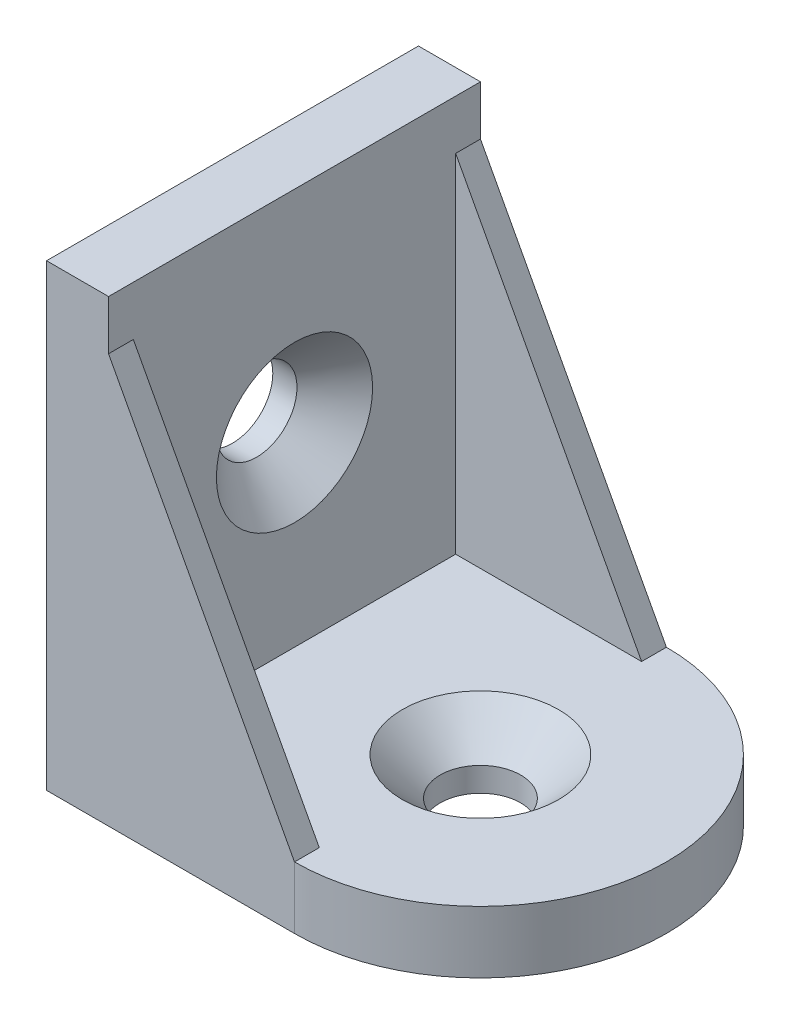
ISO-10303-21;
HEADER;
FILE_DESCRIPTION(('STEP AP214'),'2;1');
FILE_NAME('part.step','',(''),(''),'','','');
FILE_SCHEMA(('AUTOMOTIVE_DESIGN { 1 0 10303 214 1 1 1 1 }'));
ENDSEC;
DATA;
#1=APPLICATION_CONTEXT('core data for automotive mechanical design processes');
#2=APPLICATION_PROTOCOL_DEFINITION('international standard','automotive_design',2000,#1);
#3=PRODUCT_CONTEXT('',#1,'mechanical');
#4=PRODUCT('Part','Part','',(#3));
#5=PRODUCT_RELATED_PRODUCT_CATEGORY('part','',(#4));
#6=PRODUCT_DEFINITION_FORMATION('','',#4);
#7=PRODUCT_DEFINITION_CONTEXT('part definition',#1,'design');
#8=PRODUCT_DEFINITION('design','',#6,#7);
#9=PRODUCT_DEFINITION_SHAPE('','',#8);
#10=(LENGTH_UNIT() NAMED_UNIT(*) SI_UNIT(.MILLI.,.METRE.));
#11=(NAMED_UNIT(*) PLANE_ANGLE_UNIT() SI_UNIT($,.RADIAN.));
#12=(NAMED_UNIT(*) SI_UNIT($,.STERADIAN.) SOLID_ANGLE_UNIT());
#13=UNCERTAINTY_MEASURE_WITH_UNIT(LENGTH_MEASURE(1.E-05),#10,'distance_accuracy_value','');
#14=(GEOMETRIC_REPRESENTATION_CONTEXT(3) GLOBAL_UNCERTAINTY_ASSIGNED_CONTEXT((#13)) GLOBAL_UNIT_ASSIGNED_CONTEXT((#10,
#11,#12)) REPRESENTATION_CONTEXT('',''));
#15=CARTESIAN_POINT('',(0.,0.,0.));
#16=DIRECTION('',(0.,0.,1.));
#17=DIRECTION('',(1.,0.,0.));
#18=AXIS2_PLACEMENT_3D('',#15,#16,#17);
#19=CARTESIAN_POINT('',(5.,5.,15.));
#20=DIRECTION('',(0.,-1.,0.));
#21=DIRECTION('',(0.,0.,-1.));
#22=AXIS2_PLACEMENT_3D('',#19,#20,#21);
#23=PLANE('',#22);
#24=CARTESIAN_POINT('',(20.,5.,0.));
#25=DIRECTION('',(0.,1.,0.));
#26=DIRECTION('',(0.,0.,1.));
#27=AXIS2_PLACEMENT_3D('',#24,#25,#26);
#28=CIRCLE('',#27,6.3);
#29=CARTESIAN_POINT('',(20.,5.,6.3));
#30=VERTEX_POINT('',#29);
#31=EDGE_CURVE('E174',#30,#30,#28,.T.);
#32=ORIENTED_EDGE('',*,*,#31,.F.);
#33=EDGE_LOOP('',(#32));
#34=FACE_BOUND('',#33,.T.);
#35=DIRECTION('',(0.,0.,-1.));
#36=VECTOR('',#35,1.);
#37=CARTESIAN_POINT('',(20.,5.,-13.));
#38=LINE('',#37,#36);
#39=CARTESIAN_POINT('',(20.,5.,-13.));
#40=VERTEX_POINT('',#39);
#41=CARTESIAN_POINT('',(20.,5.,-15.));
#42=VERTEX_POINT('',#41);
#43=EDGE_CURVE('E82',#40,#42,#38,.T.);
#44=ORIENTED_EDGE('',*,*,#43,.F.);
#45=DIRECTION('',(1.,0.,0.));
#46=VECTOR('',#45,1.);
#47=CARTESIAN_POINT('',(20.,5.,-13.));
#48=LINE('',#47,#46);
#49=CARTESIAN_POINT('',(5.,5.,-13.));
#50=VERTEX_POINT('',#49);
#51=EDGE_CURVE('E156',#50,#40,#48,.T.);
#52=ORIENTED_EDGE('',*,*,#51,.F.);
#53=DIRECTION('',(0.,0.,-1.));
#54=VECTOR('',#53,1.);
#55=CARTESIAN_POINT('',(5.,5.,15.));
#56=LINE('',#55,#54);
#57=CARTESIAN_POINT('',(5.,5.,13.));
#58=VERTEX_POINT('',#57);
#59=EDGE_CURVE('E151',#58,#50,#56,.T.);
#60=ORIENTED_EDGE('',*,*,#59,.F.);
#61=DIRECTION('',(1.,0.,0.));
#62=VECTOR('',#61,1.);
#63=CARTESIAN_POINT('',(20.,5.,13.));
#64=LINE('',#63,#62);
#65=CARTESIAN_POINT('',(20.,5.,13.));
#66=VERTEX_POINT('',#65);
#67=EDGE_CURVE('E140',#58,#66,#64,.T.);
#68=ORIENTED_EDGE('',*,*,#67,.T.);
#69=DIRECTION('',(0.,0.,1.));
#70=VECTOR('',#69,1.);
#71=CARTESIAN_POINT('',(20.,5.,13.));
#72=LINE('',#71,#70);
#73=CARTESIAN_POINT('',(20.,5.,15.));
#74=VERTEX_POINT('',#73);
#75=EDGE_CURVE('E190',#66,#74,#72,.T.);
#76=ORIENTED_EDGE('',*,*,#75,.T.);
#77=CARTESIAN_POINT('',(20.,5.,0.));
#78=DIRECTION('',(0.,1.,0.));
#79=DIRECTION('',(0.,0.,1.));
#80=AXIS2_PLACEMENT_3D('',#77,#78,#79);
#81=CIRCLE('',#80,15.);
#82=EDGE_CURVE('E198',#42,#74,#81,.F.);
#83=ORIENTED_EDGE('',*,*,#82,.F.);
#84=EDGE_LOOP('',(#44,#52,#60,#68,#76,#83));
#85=FACE_BOUND('',#84,.T.);
#86=ADVANCED_FACE('F65',(#34,#85),#23,.F.);
#87=CARTESIAN_POINT('',(5.,37.,15.));
#88=DIRECTION('',(-1.,0.,0.));
#89=DIRECTION('',(0.,-1.,0.));
#90=AXIS2_PLACEMENT_3D('',#87,#88,#89);
#91=PLANE('',#90);
#92=CARTESIAN_POINT('',(5.,20.,0.));
#93=DIRECTION('',(1.,0.,0.));
#94=DIRECTION('',(0.,0.,-1.));
#95=AXIS2_PLACEMENT_3D('',#92,#93,#94);
#96=CIRCLE('',#95,6.3);
#97=CARTESIAN_POINT('',(5.,20.,-6.3));
#98=VERTEX_POINT('',#97);
#99=EDGE_CURVE('E302',#98,#98,#96,.T.);
#100=ORIENTED_EDGE('',*,*,#99,.F.);
#101=EDGE_LOOP('',(#100));
#102=FACE_BOUND('',#101,.T.);
#103=DIRECTION('',(0.,0.,-1.));
#104=VECTOR('',#103,1.);
#105=CARTESIAN_POINT('',(5.,33.,-13.));
#106=LINE('',#105,#104);
#107=CARTESIAN_POINT('',(5.,33.,-13.));
#108=VERTEX_POINT('',#107);
#109=CARTESIAN_POINT('',(5.,33.,-15.));
#110=VERTEX_POINT('',#109);
#111=EDGE_CURVE('E185',#108,#110,#106,.T.);
#112=ORIENTED_EDGE('',*,*,#111,.T.);
#113=DIRECTION('',(0.,1.,0.));
#114=VECTOR('',#113,1.);
#115=CARTESIAN_POINT('',(5.,37.,-15.));
#116=LINE('',#115,#114);
#117=CARTESIAN_POINT('',(5.,37.,-15.));
#118=VERTEX_POINT('',#117);
#119=EDGE_CURVE('E210',#110,#118,#116,.T.);
#120=ORIENTED_EDGE('',*,*,#119,.T.);
#121=DIRECTION('',(0.,0.,-1.));
#122=VECTOR('',#121,1.);
#123=CARTESIAN_POINT('',(5.,37.,15.));
#124=LINE('',#123,#122);
#125=CARTESIAN_POINT('',(5.,37.,15.));
#126=VERTEX_POINT('',#125);
#127=EDGE_CURVE('E157',#126,#118,#124,.T.);
#128=ORIENTED_EDGE('',*,*,#127,.F.);
#129=DIRECTION('',(0.,1.,0.));
#130=VECTOR('',#129,1.);
#131=CARTESIAN_POINT('',(5.,37.,15.));
#132=LINE('',#131,#130);
#133=CARTESIAN_POINT('',(5.,33.,15.));
#134=VERTEX_POINT('',#133);
#135=EDGE_CURVE('E162',#134,#126,#132,.T.);
#136=ORIENTED_EDGE('',*,*,#135,.F.);
#137=DIRECTION('',(0.,0.,1.));
#138=VECTOR('',#137,1.);
#139=CARTESIAN_POINT('',(5.,33.,13.));
#140=LINE('',#139,#138);
#141=CARTESIAN_POINT('',(5.,33.,13.));
#142=VERTEX_POINT('',#141);
#143=EDGE_CURVE('E153',#142,#134,#140,.T.);
#144=ORIENTED_EDGE('',*,*,#143,.F.);
#145=DIRECTION('',(0.,-1.,0.));
#146=VECTOR('',#145,1.);
#147=CARTESIAN_POINT('',(5.,5.,13.));
#148=LINE('',#147,#146);
#149=EDGE_CURVE('E143',#142,#58,#148,.T.);
#150=ORIENTED_EDGE('',*,*,#149,.T.);
#151=ORIENTED_EDGE('',*,*,#59,.T.);
#152=DIRECTION('',(0.,-1.,0.));
#153=VECTOR('',#152,1.);
#154=CARTESIAN_POINT('',(5.,5.,-13.));
#155=LINE('',#154,#153);
#156=EDGE_CURVE('E90',#108,#50,#155,.T.);
#157=ORIENTED_EDGE('',*,*,#156,.F.);
#158=EDGE_LOOP('',(#112,#120,#128,#136,#144,#150,#151,#157));
#159=FACE_BOUND('',#158,.T.);
#160=ADVANCED_FACE('F150',(#102,#159),#91,.F.);
#161=CARTESIAN_POINT('',(0.,0.,15.));
#162=DIRECTION('',(0.,1.,0.));
#163=DIRECTION('',(0.,0.,1.));
#164=AXIS2_PLACEMENT_3D('',#161,#162,#163);
#165=PLANE('',#164);
#166=CARTESIAN_POINT('',(20.,0.,0.));
#167=DIRECTION('',(0.,1.,0.));
#168=DIRECTION('',(0.,0.,1.));
#169=AXIS2_PLACEMENT_3D('',#166,#167,#168);
#170=CIRCLE('',#169,3.25);
#171=CARTESIAN_POINT('',(20.,0.,3.25));
#172=VERTEX_POINT('',#171);
#173=EDGE_CURVE('E165',#172,#172,#170,.T.);
#174=ORIENTED_EDGE('',*,*,#173,.T.);
#175=EDGE_LOOP('',(#174));
#176=FACE_BOUND('',#175,.T.);
#177=CARTESIAN_POINT('',(20.,0.,0.));
#178=DIRECTION('',(0.,1.,0.));
#179=DIRECTION('',(0.,0.,1.));
#180=AXIS2_PLACEMENT_3D('',#177,#178,#179);
#181=CIRCLE('',#180,15.);
#182=CARTESIAN_POINT('',(20.,0.,-15.));
#183=VERTEX_POINT('',#182);
#184=CARTESIAN_POINT('',(20.,0.,15.));
#185=VERTEX_POINT('',#184);
#186=EDGE_CURVE('E199',#183,#185,#181,.F.);
#187=ORIENTED_EDGE('',*,*,#186,.T.);
#188=DIRECTION('',(1.,0.,0.));
#189=VECTOR('',#188,1.);
#190=CARTESIAN_POINT('',(0.,0.,15.));
#191=LINE('',#190,#189);
#192=CARTESIAN_POINT('',(0.,0.,15.));
#193=VERTEX_POINT('',#192);
#194=EDGE_CURVE('E212',#193,#185,#191,.T.);
#195=ORIENTED_EDGE('',*,*,#194,.F.);
#196=DIRECTION('',(0.,0.,-1.));
#197=VECTOR('',#196,1.);
#198=CARTESIAN_POINT('',(0.,0.,15.));
#199=LINE('',#198,#197);
#200=CARTESIAN_POINT('',(0.,0.,-15.));
#201=VERTEX_POINT('',#200);
#202=EDGE_CURVE('E74',#193,#201,#199,.T.);
#203=ORIENTED_EDGE('',*,*,#202,.T.);
#204=DIRECTION('',(1.,0.,0.));
#205=VECTOR('',#204,1.);
#206=CARTESIAN_POINT('',(0.,0.,-15.));
#207=LINE('',#206,#205);
#208=EDGE_CURVE('E220',#201,#183,#207,.T.);
#209=ORIENTED_EDGE('',*,*,#208,.T.);
#210=EDGE_LOOP('',(#187,#195,#203,#209));
#211=FACE_BOUND('',#210,.T.);
#212=ADVANCED_FACE('F246',(#176,#211),#165,.F.);
#213=CARTESIAN_POINT('',(5.,37.,15.));
#214=DIRECTION('',(0.,-1.,0.));
#215=DIRECTION('',(0.,0.,-1.));
#216=AXIS2_PLACEMENT_3D('',#213,#214,#215);
#217=PLANE('',#216);
#218=DIRECTION('',(-1.,0.,0.));
#219=VECTOR('',#218,1.);
#220=CARTESIAN_POINT('',(5.,37.,-15.));
#221=LINE('',#220,#219);
#222=CARTESIAN_POINT('',(0.,37.,-15.));
#223=VERTEX_POINT('',#222);
#224=EDGE_CURVE('E205',#118,#223,#221,.T.);
#225=ORIENTED_EDGE('',*,*,#224,.T.);
#226=DIRECTION('',(0.,0.,-1.));
#227=VECTOR('',#226,1.);
#228=CARTESIAN_POINT('',(0.,37.,15.));
#229=LINE('',#228,#227);
#230=CARTESIAN_POINT('',(0.,37.,15.));
#231=VERTEX_POINT('',#230);
#232=EDGE_CURVE('E14',#231,#223,#229,.T.);
#233=ORIENTED_EDGE('',*,*,#232,.F.);
#234=DIRECTION('',(-1.,0.,0.));
#235=VECTOR('',#234,1.);
#236=CARTESIAN_POINT('',(5.,37.,15.));
#237=LINE('',#236,#235);
#238=EDGE_CURVE('E206',#126,#231,#237,.T.);
#239=ORIENTED_EDGE('',*,*,#238,.F.);
#240=ORIENTED_EDGE('',*,*,#127,.T.);
#241=EDGE_LOOP('',(#225,#233,#239,#240));
#242=FACE_BOUND('',#241,.T.);
#243=ADVANCED_FACE('F67',(#242),#217,.F.);
#244=CARTESIAN_POINT('',(0.,37.,15.));
#245=DIRECTION('',(1.,0.,0.));
#246=DIRECTION('',(0.,1.,0.));
#247=AXIS2_PLACEMENT_3D('',#244,#245,#246);
#248=PLANE('',#247);
#249=CARTESIAN_POINT('',(0.,20.,0.));
#250=DIRECTION('',(1.,0.,0.));
#251=DIRECTION('',(0.,1.,0.));
#252=AXIS2_PLACEMENT_3D('',#249,#250,#251);
#253=CIRCLE('',#252,3.25);
#254=CARTESIAN_POINT('',(0.,23.25,0.));
#255=VERTEX_POINT('',#254);
#256=EDGE_CURVE('E69',#255,#255,#253,.T.);
#257=ORIENTED_EDGE('',*,*,#256,.T.);
#258=EDGE_LOOP('',(#257));
#259=FACE_BOUND('',#258,.T.);
#260=DIRECTION('',(0.,-1.,0.));
#261=VECTOR('',#260,1.);
#262=CARTESIAN_POINT('',(0.,37.,-15.));
#263=LINE('',#262,#261);
#264=EDGE_CURVE('E218',#223,#201,#263,.T.);
#265=ORIENTED_EDGE('',*,*,#264,.T.);
#266=ORIENTED_EDGE('',*,*,#202,.F.);
#267=DIRECTION('',(0.,-1.,0.));
#268=VECTOR('',#267,1.);
#269=CARTESIAN_POINT('',(0.,37.,15.));
#270=LINE('',#269,#268);
#271=EDGE_CURVE('E209',#231,#193,#270,.T.);
#272=ORIENTED_EDGE('',*,*,#271,.F.);
#273=ORIENTED_EDGE('',*,*,#232,.T.);
#274=EDGE_LOOP('',(#265,#266,#272,#273));
#275=FACE_BOUND('',#274,.T.);
#276=ADVANCED_FACE('F236',(#259,#275),#248,.F.);
#277=CARTESIAN_POINT('',(0.,0.,15.));
#278=DIRECTION('',(0.,0.,1.));
#279=DIRECTION('',(1.,0.,0.));
#280=AXIS2_PLACEMENT_3D('',#277,#278,#279);
#281=PLANE('',#280);
#282=DIRECTION('',(-0.472221412515419,0.881479970028782,0.));
#283=VECTOR('',#282,1.);
#284=CARTESIAN_POINT('',(5.,33.,15.));
#285=LINE('',#284,#283);
#286=EDGE_CURVE('E154',#74,#134,#285,.T.);
#287=ORIENTED_EDGE('',*,*,#286,.T.);
#288=ORIENTED_EDGE('',*,*,#135,.T.);
#289=ORIENTED_EDGE('',*,*,#238,.T.);
#290=ORIENTED_EDGE('',*,*,#271,.T.);
#291=ORIENTED_EDGE('',*,*,#194,.T.);
#292=DIRECTION('',(0.,1.,0.));
#293=VECTOR('',#292,1.);
#294=CARTESIAN_POINT('',(20.,0.,15.));
#295=LINE('',#294,#293);
#296=EDGE_CURVE('E194',#185,#74,#295,.T.);
#297=ORIENTED_EDGE('',*,*,#296,.T.);
#298=EDGE_LOOP('',(#287,#288,#289,#290,#291,#297));
#299=FACE_BOUND('',#298,.T.);
#300=ADVANCED_FACE('F239',(#299),#281,.T.);
#301=CARTESIAN_POINT('',(0.,0.,-15.));
#302=DIRECTION('',(0.,0.,1.));
#303=DIRECTION('',(1.,0.,0.));
#304=AXIS2_PLACEMENT_3D('',#301,#302,#303);
#305=PLANE('',#304);
#306=ORIENTED_EDGE('',*,*,#119,.F.);
#307=DIRECTION('',(-0.472221412515419,0.881479970028782,0.));
#308=VECTOR('',#307,1.);
#309=CARTESIAN_POINT('',(5.,33.,-15.));
#310=LINE('',#309,#308);
#311=EDGE_CURVE('E167',#42,#110,#310,.T.);
#312=ORIENTED_EDGE('',*,*,#311,.F.);
#313=DIRECTION('',(0.,1.,0.));
#314=VECTOR('',#313,1.);
#315=CARTESIAN_POINT('',(20.,0.,-15.));
#316=LINE('',#315,#314);
#317=EDGE_CURVE('E201',#183,#42,#316,.T.);
#318=ORIENTED_EDGE('',*,*,#317,.F.);
#319=ORIENTED_EDGE('',*,*,#208,.F.);
#320=ORIENTED_EDGE('',*,*,#264,.F.);
#321=ORIENTED_EDGE('',*,*,#224,.F.);
#322=EDGE_LOOP('',(#306,#312,#318,#319,#320,#321));
#323=FACE_BOUND('',#322,.T.);
#324=ADVANCED_FACE('F231',(#323),#305,.F.);
#325=CARTESIAN_POINT('',(20.,0.,0.));
#326=DIRECTION('',(0.,1.,0.));
#327=DIRECTION('',(0.,0.,1.));
#328=AXIS2_PLACEMENT_3D('',#325,#326,#327);
#329=CYLINDRICAL_SURFACE('',#328,15.);
#330=ORIENTED_EDGE('',*,*,#82,.T.);
#331=ORIENTED_EDGE('',*,*,#296,.F.);
#332=ORIENTED_EDGE('',*,*,#186,.F.);
#333=ORIENTED_EDGE('',*,*,#317,.T.);
#334=EDGE_LOOP('',(#330,#331,#332,#333));
#335=FACE_BOUND('',#334,.T.);
#336=ADVANCED_FACE('F244',(#335),#329,.T.);
#337=CARTESIAN_POINT('',(5.,33.,13.));
#338=DIRECTION('',(0.881479970028782,0.472221412515419,0.));
#339=DIRECTION('',(-0.472221412515419,0.881479970028782,0.));
#340=AXIS2_PLACEMENT_3D('',#337,#338,#339);
#341=PLANE('',#340);
#342=ORIENTED_EDGE('',*,*,#286,.F.);
#343=ORIENTED_EDGE('',*,*,#75,.F.);
#344=DIRECTION('',(-0.472221412515419,0.881479970028782,0.));
#345=VECTOR('',#344,1.);
#346=CARTESIAN_POINT('',(5.,33.,13.));
#347=LINE('',#346,#345);
#348=EDGE_CURVE('E145',#66,#142,#347,.T.);
#349=ORIENTED_EDGE('',*,*,#348,.T.);
#350=ORIENTED_EDGE('',*,*,#143,.T.);
#351=EDGE_LOOP('',(#342,#343,#349,#350));
#352=FACE_BOUND('',#351,.T.);
#353=ADVANCED_FACE('F242',(#352),#341,.T.);
#354=CARTESIAN_POINT('',(0.,0.,13.));
#355=DIRECTION('',(0.,0.,1.));
#356=DIRECTION('',(1.,0.,0.));
#357=AXIS2_PLACEMENT_3D('',#354,#355,#356);
#358=PLANE('',#357);
#359=ORIENTED_EDGE('',*,*,#149,.F.);
#360=ORIENTED_EDGE('',*,*,#348,.F.);
#361=ORIENTED_EDGE('',*,*,#67,.F.);
#362=EDGE_LOOP('',(#359,#360,#361));
#363=FACE_BOUND('',#362,.T.);
#364=ADVANCED_FACE('F142',(#363),#358,.F.);
#365=CARTESIAN_POINT('',(5.,33.,-13.));
#366=DIRECTION('',(-0.881479970028782,-0.472221412515419,0.));
#367=DIRECTION('',(0.472221412515419,-0.881479970028782,0.));
#368=AXIS2_PLACEMENT_3D('',#365,#366,#367);
#369=PLANE('',#368);
#370=ORIENTED_EDGE('',*,*,#311,.T.);
#371=ORIENTED_EDGE('',*,*,#111,.F.);
#372=DIRECTION('',(-0.472221412515419,0.881479970028782,0.));
#373=VECTOR('',#372,1.);
#374=CARTESIAN_POINT('',(5.,33.,-13.));
#375=LINE('',#374,#373);
#376=EDGE_CURVE('E183',#40,#108,#375,.T.);
#377=ORIENTED_EDGE('',*,*,#376,.F.);
#378=ORIENTED_EDGE('',*,*,#43,.T.);
#379=EDGE_LOOP('',(#370,#371,#377,#378));
#380=FACE_BOUND('',#379,.T.);
#381=ADVANCED_FACE('F272',(#380),#369,.F.);
#382=CARTESIAN_POINT('',(0.,0.,-13.));
#383=DIRECTION('',(0.,0.,-1.));
#384=DIRECTION('',(1.,0.,0.));
#385=AXIS2_PLACEMENT_3D('',#382,#383,#384);
#386=PLANE('',#385);
#387=ORIENTED_EDGE('',*,*,#156,.T.);
#388=ORIENTED_EDGE('',*,*,#51,.T.);
#389=ORIENTED_EDGE('',*,*,#376,.T.);
#390=EDGE_LOOP('',(#387,#388,#389));
#391=FACE_BOUND('',#390,.T.);
#392=ADVANCED_FACE('F275',(#391),#386,.F.);
#393=CARTESIAN_POINT('',(20.,5.,0.));
#394=DIRECTION('',(0.,1.,0.));
#395=DIRECTION('',(0.,0.,1.));
#396=AXIS2_PLACEMENT_3D('',#393,#394,#395);
#397=CYLINDRICAL_SURFACE('',#396,3.25);
#398=CARTESIAN_POINT('',(20.,1.95,0.));
#399=DIRECTION('',(0.,1.,0.));
#400=DIRECTION('',(0.,0.,1.));
#401=AXIS2_PLACEMENT_3D('',#398,#399,#400);
#402=CIRCLE('',#401,3.25);
#403=CARTESIAN_POINT('',(20.,1.95,3.25));
#404=VERTEX_POINT('',#403);
#405=EDGE_CURVE('E168',#404,#404,#402,.T.);
#406=ORIENTED_EDGE('',*,*,#405,.T.);
#407=EDGE_LOOP('',(#406));
#408=FACE_BOUND('',#407,.T.);
#409=ORIENTED_EDGE('',*,*,#173,.F.);
#410=EDGE_LOOP('',(#409));
#411=FACE_BOUND('',#410,.T.);
#412=ADVANCED_FACE('F279',(#408,#411),#397,.F.);
#413=CARTESIAN_POINT('',(20.,5.,0.));
#414=DIRECTION('',(0.,1.,0.));
#415=DIRECTION('',(0.,0.,1.));
#416=AXIS2_PLACEMENT_3D('',#413,#414,#415);
#417=CONICAL_SURFACE('',#416,6.3,0.785398163397448);
#418=ORIENTED_EDGE('',*,*,#405,.F.);
#419=EDGE_LOOP('',(#418));
#420=FACE_BOUND('',#419,.T.);
#421=ORIENTED_EDGE('',*,*,#31,.T.);
#422=EDGE_LOOP('',(#421));
#423=FACE_BOUND('',#422,.T.);
#424=ADVANCED_FACE('F283',(#420,#423),#417,.F.);
#425=CARTESIAN_POINT('',(5.,20.,0.));
#426=DIRECTION('',(1.,0.,0.));
#427=DIRECTION('',(0.,0.,-1.));
#428=AXIS2_PLACEMENT_3D('',#425,#426,#427);
#429=CYLINDRICAL_SURFACE('',#428,3.25);
#430=CARTESIAN_POINT('',(1.95,20.,0.));
#431=DIRECTION('',(1.,0.,0.));
#432=DIRECTION('',(0.,0.,-1.));
#433=AXIS2_PLACEMENT_3D('',#430,#431,#432);
#434=CIRCLE('',#433,3.25);
#435=CARTESIAN_POINT('',(1.95,20.,-3.25));
#436=VERTEX_POINT('',#435);
#437=EDGE_CURVE('E299',#436,#436,#434,.T.);
#438=ORIENTED_EDGE('',*,*,#437,.T.);
#439=EDGE_LOOP('',(#438));
#440=FACE_BOUND('',#439,.T.);
#441=ORIENTED_EDGE('',*,*,#256,.F.);
#442=EDGE_LOOP('',(#441));
#443=FACE_BOUND('',#442,.T.);
#444=ADVANCED_FACE('F286',(#440,#443),#429,.F.);
#445=CARTESIAN_POINT('',(5.,20.,0.));
#446=DIRECTION('',(1.,0.,0.));
#447=DIRECTION('',(0.,0.,-1.));
#448=AXIS2_PLACEMENT_3D('',#445,#446,#447);
#449=CONICAL_SURFACE('',#448,6.3,0.785398163397448);
#450=ORIENTED_EDGE('',*,*,#437,.F.);
#451=EDGE_LOOP('',(#450));
#452=FACE_BOUND('',#451,.T.);
#453=ORIENTED_EDGE('',*,*,#99,.T.);
#454=EDGE_LOOP('',(#453));
#455=FACE_BOUND('',#454,.T.);
#456=ADVANCED_FACE('F290',(#452,#455),#449,.F.);
#457=CLOSED_SHELL('',(#86,#160,#212,#243,#276,#300,#324,#336,#353,#364,#381,#392,#412,#424,#444,#456));
#458=MANIFOLD_SOLID_BREP('B2',#457);
#459=ADVANCED_BREP_SHAPE_REPRESENTATION('',(#18,#458),#14);
#460=SHAPE_DEFINITION_REPRESENTATION(#9,#459);
ENDSEC;
END-ISO-10303-21;
